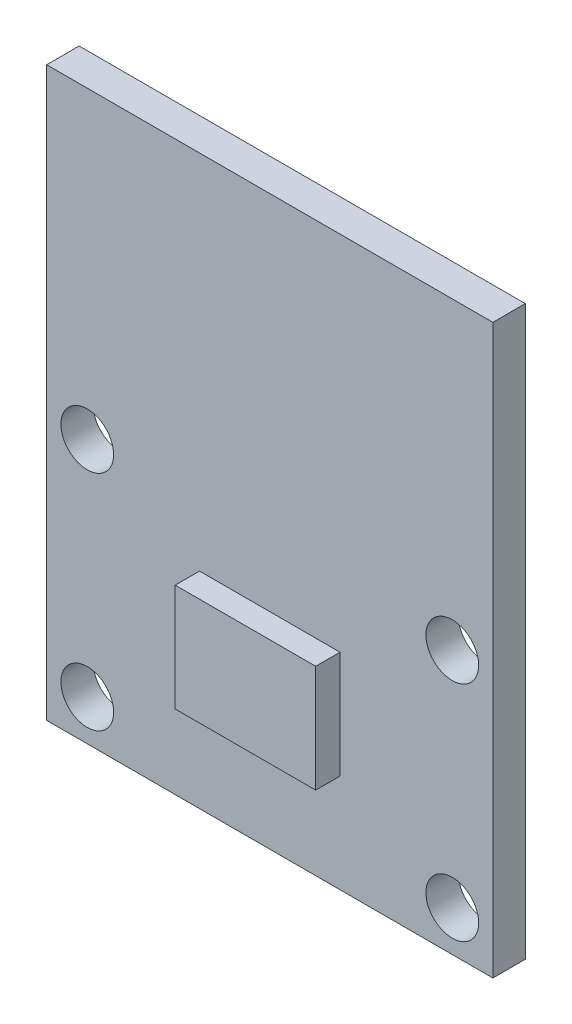
ISO-10303-21;
HEADER;
FILE_DESCRIPTION(('STEP AP214'),'2;1');
FILE_NAME('part.step','',(''),(''),'','','');
FILE_SCHEMA(('AUTOMOTIVE_DESIGN { 1 0 10303 214 1 1 1 1 }'));
ENDSEC;
DATA;
#1=APPLICATION_CONTEXT('core data for automotive mechanical design processes');
#2=APPLICATION_PROTOCOL_DEFINITION('international standard','automotive_design',2000,#1);
#3=PRODUCT_CONTEXT('',#1,'mechanical');
#4=PRODUCT('Part','Part','',(#3));
#5=PRODUCT_RELATED_PRODUCT_CATEGORY('part','',(#4));
#6=PRODUCT_DEFINITION_FORMATION('','',#4);
#7=PRODUCT_DEFINITION_CONTEXT('part definition',#1,'design');
#8=PRODUCT_DEFINITION('design','',#6,#7);
#9=PRODUCT_DEFINITION_SHAPE('','',#8);
#10=(LENGTH_UNIT() NAMED_UNIT(*) SI_UNIT(.MILLI.,.METRE.));
#11=(NAMED_UNIT(*) PLANE_ANGLE_UNIT() SI_UNIT($,.RADIAN.));
#12=(NAMED_UNIT(*) SI_UNIT($,.STERADIAN.) SOLID_ANGLE_UNIT());
#13=UNCERTAINTY_MEASURE_WITH_UNIT(LENGTH_MEASURE(1.E-05),#10,'distance_accuracy_value','');
#14=(GEOMETRIC_REPRESENTATION_CONTEXT(3) GLOBAL_UNCERTAINTY_ASSIGNED_CONTEXT((#13)) GLOBAL_UNIT_ASSIGNED_CONTEXT((#10,
#11,#12)) REPRESENTATION_CONTEXT('',''));
#15=CARTESIAN_POINT('',(0.,0.,0.));
#16=DIRECTION('',(0.,0.,1.));
#17=DIRECTION('',(1.,0.,0.));
#18=AXIS2_PLACEMENT_3D('',#15,#16,#17);
#19=CARTESIAN_POINT('',(0.,0.,1.6));
#20=DIRECTION('',(0.,0.,1.));
#21=DIRECTION('',(1.,0.,0.));
#22=AXIS2_PLACEMENT_3D('',#19,#20,#21);
#23=PLANE('',#22);
#24=CARTESIAN_POINT('',(-9.,-1.,1.6));
#25=DIRECTION('',(0.,0.,1.));
#26=DIRECTION('',(1.,0.,0.));
#27=AXIS2_PLACEMENT_3D('',#24,#25,#26);
#28=CIRCLE('',#27,1.3);
#29=CARTESIAN_POINT('',(-7.7,-1.,1.6));
#30=VERTEX_POINT('',#29);
#31=EDGE_CURVE('E146',#30,#30,#28,.T.);
#32=ORIENTED_EDGE('',*,*,#31,.F.);
#33=EDGE_LOOP('',(#32));
#34=FACE_BOUND('',#33,.T.);
#35=CARTESIAN_POINT('',(-9.,-12.,1.6));
#36=DIRECTION('',(0.,0.,1.));
#37=DIRECTION('',(1.,0.,0.));
#38=AXIS2_PLACEMENT_3D('',#35,#36,#37);
#39=CIRCLE('',#38,1.3);
#40=CARTESIAN_POINT('',(-7.7,-12.,1.6));
#41=VERTEX_POINT('',#40);
#42=EDGE_CURVE('E158',#41,#41,#39,.T.);
#43=ORIENTED_EDGE('',*,*,#42,.F.);
#44=EDGE_LOOP('',(#43));
#45=FACE_BOUND('',#44,.T.);
#46=DIRECTION('',(0.,1.,0.));
#47=VECTOR('',#46,1.);
#48=CARTESIAN_POINT('',(11.,14.,1.6));
#49=LINE('',#48,#47);
#50=CARTESIAN_POINT('',(11.,-14.,1.6));
#51=VERTEX_POINT('',#50);
#52=CARTESIAN_POINT('',(11.,14.,1.6));
#53=VERTEX_POINT('',#52);
#54=EDGE_CURVE('E164',#51,#53,#49,.T.);
#55=ORIENTED_EDGE('',*,*,#54,.T.);
#56=DIRECTION('',(-1.,0.,0.));
#57=VECTOR('',#56,1.);
#58=CARTESIAN_POINT('',(-11.,14.,1.6));
#59=LINE('',#58,#57);
#60=CARTESIAN_POINT('',(-11.,14.,1.6));
#61=VERTEX_POINT('',#60);
#62=EDGE_CURVE('E88',#53,#61,#59,.T.);
#63=ORIENTED_EDGE('',*,*,#62,.T.);
#64=DIRECTION('',(0.,-1.,0.));
#65=VECTOR('',#64,1.);
#66=CARTESIAN_POINT('',(-11.,14.,1.6));
#67=LINE('',#66,#65);
#68=CARTESIAN_POINT('',(-11.,-14.,1.6));
#69=VERTEX_POINT('',#68);
#70=EDGE_CURVE('E167',#61,#69,#67,.T.);
#71=ORIENTED_EDGE('',*,*,#70,.T.);
#72=DIRECTION('',(1.,0.,0.));
#73=VECTOR('',#72,1.);
#74=CARTESIAN_POINT('',(-11.,-14.,1.6));
#75=LINE('',#74,#73);
#76=EDGE_CURVE('E60',#69,#51,#75,.T.);
#77=ORIENTED_EDGE('',*,*,#76,.T.);
#78=EDGE_LOOP('',(#55,#63,#71,#77));
#79=FACE_BOUND('',#78,.T.);
#80=CARTESIAN_POINT('',(9.,-12.,1.6));
#81=DIRECTION('',(0.,0.,1.));
#82=DIRECTION('',(1.,0.,0.));
#83=AXIS2_PLACEMENT_3D('',#80,#81,#82);
#84=CIRCLE('',#83,1.3);
#85=CARTESIAN_POINT('',(10.3,-12.,1.6));
#86=VERTEX_POINT('',#85);
#87=EDGE_CURVE('E152',#86,#86,#84,.T.);
#88=ORIENTED_EDGE('',*,*,#87,.F.);
#89=EDGE_LOOP('',(#88));
#90=FACE_BOUND('',#89,.T.);
#91=CARTESIAN_POINT('',(9.,-1.,1.6));
#92=DIRECTION('',(0.,0.,1.));
#93=DIRECTION('',(1.,0.,0.));
#94=AXIS2_PLACEMENT_3D('',#91,#92,#93);
#95=CIRCLE('',#94,1.3);
#96=CARTESIAN_POINT('',(10.3,-1.,1.6));
#97=VERTEX_POINT('',#96);
#98=EDGE_CURVE('E138',#97,#97,#95,.T.);
#99=ORIENTED_EDGE('',*,*,#98,.F.);
#100=EDGE_LOOP('',(#99));
#101=FACE_BOUND('',#100,.T.);
#102=DIRECTION('',(-1.,0.,0.));
#103=VECTOR('',#102,1.);
#104=CARTESIAN_POINT('',(-3.46343343206932,-3.85520353665282,1.6));
#105=LINE('',#104,#103);
#106=CARTESIAN_POINT('',(3.46343343206932,-3.85520353665282,1.6));
#107=VERTEX_POINT('',#106);
#108=CARTESIAN_POINT('',(-3.46343343206932,-3.85520353665282,1.6));
#109=VERTEX_POINT('',#108);
#110=EDGE_CURVE('E334',#107,#109,#105,.T.);
#111=ORIENTED_EDGE('',*,*,#110,.F.);
#112=DIRECTION('',(0.,1.,0.));
#113=VECTOR('',#112,1.);
#114=CARTESIAN_POINT('',(3.46343343206932,-3.85520353665282,1.6));
#115=LINE('',#114,#113);
#116=CARTESIAN_POINT('',(3.46343343206932,-9.14479646334718,1.6));
#117=VERTEX_POINT('',#116);
#118=EDGE_CURVE('E133',#117,#107,#115,.T.);
#119=ORIENTED_EDGE('',*,*,#118,.F.);
#120=DIRECTION('',(1.,0.,0.));
#121=VECTOR('',#120,1.);
#122=CARTESIAN_POINT('',(-3.46343343206932,-9.14479646334718,1.6));
#123=LINE('',#122,#121);
#124=CARTESIAN_POINT('',(-3.46343343206932,-9.14479646334718,1.6));
#125=VERTEX_POINT('',#124);
#126=EDGE_CURVE('E129',#125,#117,#123,.T.);
#127=ORIENTED_EDGE('',*,*,#126,.F.);
#128=DIRECTION('',(0.,-1.,0.));
#129=VECTOR('',#128,1.);
#130=CARTESIAN_POINT('',(-3.46343343206932,-3.85520353665282,1.6));
#131=LINE('',#130,#129);
#132=EDGE_CURVE('E331',#109,#125,#131,.T.);
#133=ORIENTED_EDGE('',*,*,#132,.F.);
#134=EDGE_LOOP('',(#111,#119,#127,#133));
#135=FACE_BOUND('',#134,.T.);
#136=ADVANCED_FACE('F36',(#34,#45,#79,#90,#101,#135),#23,.T.);
#137=CARTESIAN_POINT('',(0.,0.,0.));
#138=DIRECTION('',(0.,0.,1.));
#139=DIRECTION('',(1.,0.,0.));
#140=AXIS2_PLACEMENT_3D('',#137,#138,#139);
#141=PLANE('',#140);
#142=DIRECTION('',(0.,1.,0.));
#143=VECTOR('',#142,1.);
#144=CARTESIAN_POINT('',(11.,14.,0.));
#145=LINE('',#144,#143);
#146=CARTESIAN_POINT('',(11.,-14.,0.));
#147=VERTEX_POINT('',#146);
#148=CARTESIAN_POINT('',(11.,14.,0.));
#149=VERTEX_POINT('',#148);
#150=EDGE_CURVE('E161',#147,#149,#145,.T.);
#151=ORIENTED_EDGE('',*,*,#150,.F.);
#152=DIRECTION('',(1.,0.,0.));
#153=VECTOR('',#152,1.);
#154=CARTESIAN_POINT('',(-11.,-14.,0.));
#155=LINE('',#154,#153);
#156=CARTESIAN_POINT('',(-11.,-14.,0.));
#157=VERTEX_POINT('',#156);
#158=EDGE_CURVE('E81',#157,#147,#155,.T.);
#159=ORIENTED_EDGE('',*,*,#158,.F.);
#160=DIRECTION('',(0.,-1.,0.));
#161=VECTOR('',#160,1.);
#162=CARTESIAN_POINT('',(-11.,14.,0.));
#163=LINE('',#162,#161);
#164=CARTESIAN_POINT('',(-11.,14.,0.));
#165=VERTEX_POINT('',#164);
#166=EDGE_CURVE('E175',#165,#157,#163,.T.);
#167=ORIENTED_EDGE('',*,*,#166,.F.);
#168=DIRECTION('',(-1.,0.,0.));
#169=VECTOR('',#168,1.);
#170=CARTESIAN_POINT('',(-11.,14.,0.));
#171=LINE('',#170,#169);
#172=EDGE_CURVE('E173',#149,#165,#171,.T.);
#173=ORIENTED_EDGE('',*,*,#172,.F.);
#174=EDGE_LOOP('',(#151,#159,#167,#173));
#175=FACE_BOUND('',#174,.T.);
#176=CARTESIAN_POINT('',(-9.,-12.,0.));
#177=DIRECTION('',(0.,0.,1.));
#178=DIRECTION('',(1.,0.,0.));
#179=AXIS2_PLACEMENT_3D('',#176,#177,#178);
#180=CIRCLE('',#179,1.3);
#181=CARTESIAN_POINT('',(-7.7,-12.,0.));
#182=VERTEX_POINT('',#181);
#183=EDGE_CURVE('E155',#182,#182,#180,.T.);
#184=ORIENTED_EDGE('',*,*,#183,.T.);
#185=EDGE_LOOP('',(#184));
#186=FACE_BOUND('',#185,.T.);
#187=CARTESIAN_POINT('',(9.,-12.,0.));
#188=DIRECTION('',(0.,0.,1.));
#189=DIRECTION('',(1.,0.,0.));
#190=AXIS2_PLACEMENT_3D('',#187,#188,#189);
#191=CIRCLE('',#190,1.3);
#192=CARTESIAN_POINT('',(10.3,-12.,0.));
#193=VERTEX_POINT('',#192);
#194=EDGE_CURVE('E149',#193,#193,#191,.T.);
#195=ORIENTED_EDGE('',*,*,#194,.T.);
#196=EDGE_LOOP('',(#195));
#197=FACE_BOUND('',#196,.T.);
#198=CARTESIAN_POINT('',(-9.,-1.,0.));
#199=DIRECTION('',(0.,0.,1.));
#200=DIRECTION('',(1.,0.,0.));
#201=AXIS2_PLACEMENT_3D('',#198,#199,#200);
#202=CIRCLE('',#201,1.3);
#203=CARTESIAN_POINT('',(-7.7,-1.,0.));
#204=VERTEX_POINT('',#203);
#205=EDGE_CURVE('E144',#204,#204,#202,.T.);
#206=ORIENTED_EDGE('',*,*,#205,.T.);
#207=EDGE_LOOP('',(#206));
#208=FACE_BOUND('',#207,.T.);
#209=CARTESIAN_POINT('',(9.,-1.,0.));
#210=DIRECTION('',(0.,0.,1.));
#211=DIRECTION('',(1.,0.,0.));
#212=AXIS2_PLACEMENT_3D('',#209,#210,#211);
#213=CIRCLE('',#212,1.3);
#214=CARTESIAN_POINT('',(10.3,-1.,0.));
#215=VERTEX_POINT('',#214);
#216=EDGE_CURVE('E135',#215,#215,#213,.T.);
#217=ORIENTED_EDGE('',*,*,#216,.T.);
#218=EDGE_LOOP('',(#217));
#219=FACE_BOUND('',#218,.T.);
#220=ADVANCED_FACE('F188',(#175,#186,#197,#208,#219),#141,.F.);
#221=CARTESIAN_POINT('',(11.,14.,1.6));
#222=DIRECTION('',(-1.,0.,0.));
#223=DIRECTION('',(0.,-1.,0.));
#224=AXIS2_PLACEMENT_3D('',#221,#222,#223);
#225=PLANE('',#224);
#226=ORIENTED_EDGE('',*,*,#150,.T.);
#227=DIRECTION('',(0.,0.,-1.));
#228=VECTOR('',#227,1.);
#229=CARTESIAN_POINT('',(11.,14.,1.6));
#230=LINE('',#229,#228);
#231=EDGE_CURVE('E11',#53,#149,#230,.T.);
#232=ORIENTED_EDGE('',*,*,#231,.F.);
#233=ORIENTED_EDGE('',*,*,#54,.F.);
#234=DIRECTION('',(0.,0.,-1.));
#235=VECTOR('',#234,1.);
#236=CARTESIAN_POINT('',(11.,-14.,1.6));
#237=LINE('',#236,#235);
#238=EDGE_CURVE('E170',#51,#147,#237,.T.);
#239=ORIENTED_EDGE('',*,*,#238,.T.);
#240=EDGE_LOOP('',(#226,#232,#233,#239));
#241=FACE_BOUND('',#240,.T.);
#242=ADVANCED_FACE('F38',(#241),#225,.F.);
#243=CARTESIAN_POINT('',(-11.,14.,1.6));
#244=DIRECTION('',(0.,-1.,0.));
#245=DIRECTION('',(0.,0.,-1.));
#246=AXIS2_PLACEMENT_3D('',#243,#244,#245);
#247=PLANE('',#246);
#248=ORIENTED_EDGE('',*,*,#172,.T.);
#249=DIRECTION('',(0.,0.,-1.));
#250=VECTOR('',#249,1.);
#251=CARTESIAN_POINT('',(-11.,14.,1.6));
#252=LINE('',#251,#250);
#253=EDGE_CURVE('E44',#61,#165,#252,.T.);
#254=ORIENTED_EDGE('',*,*,#253,.F.);
#255=ORIENTED_EDGE('',*,*,#62,.F.);
#256=ORIENTED_EDGE('',*,*,#231,.T.);
#257=EDGE_LOOP('',(#248,#254,#255,#256));
#258=FACE_BOUND('',#257,.T.);
#259=ADVANCED_FACE('F204',(#258),#247,.F.);
#260=CARTESIAN_POINT('',(-11.,14.,1.6));
#261=DIRECTION('',(1.,0.,0.));
#262=DIRECTION('',(0.,1.,0.));
#263=AXIS2_PLACEMENT_3D('',#260,#261,#262);
#264=PLANE('',#263);
#265=ORIENTED_EDGE('',*,*,#166,.T.);
#266=DIRECTION('',(0.,0.,-1.));
#267=VECTOR('',#266,1.);
#268=CARTESIAN_POINT('',(-11.,-14.,1.6));
#269=LINE('',#268,#267);
#270=EDGE_CURVE('E179',#69,#157,#269,.T.);
#271=ORIENTED_EDGE('',*,*,#270,.F.);
#272=ORIENTED_EDGE('',*,*,#70,.F.);
#273=ORIENTED_EDGE('',*,*,#253,.T.);
#274=EDGE_LOOP('',(#265,#271,#272,#273));
#275=FACE_BOUND('',#274,.T.);
#276=ADVANCED_FACE('F184',(#275),#264,.F.);
#277=CARTESIAN_POINT('',(-11.,-14.,1.6));
#278=DIRECTION('',(0.,1.,0.));
#279=DIRECTION('',(0.,0.,1.));
#280=AXIS2_PLACEMENT_3D('',#277,#278,#279);
#281=PLANE('',#280);
#282=ORIENTED_EDGE('',*,*,#158,.T.);
#283=ORIENTED_EDGE('',*,*,#238,.F.);
#284=ORIENTED_EDGE('',*,*,#76,.F.);
#285=ORIENTED_EDGE('',*,*,#270,.T.);
#286=EDGE_LOOP('',(#282,#283,#284,#285));
#287=FACE_BOUND('',#286,.T.);
#288=ADVANCED_FACE('F193',(#287),#281,.F.);
#289=CARTESIAN_POINT('',(-9.,-12.,1.6));
#290=DIRECTION('',(0.,0.,-1.));
#291=DIRECTION('',(-1.,0.,0.));
#292=AXIS2_PLACEMENT_3D('',#289,#290,#291);
#293=CYLINDRICAL_SURFACE('',#292,1.3);
#294=ORIENTED_EDGE('',*,*,#42,.T.);
#295=EDGE_LOOP('',(#294));
#296=FACE_BOUND('',#295,.T.);
#297=ORIENTED_EDGE('',*,*,#183,.F.);
#298=EDGE_LOOP('',(#297));
#299=FACE_BOUND('',#298,.T.);
#300=ADVANCED_FACE('F195',(#296,#299),#293,.F.);
#301=CARTESIAN_POINT('',(9.,-12.,1.6));
#302=DIRECTION('',(0.,0.,-1.));
#303=DIRECTION('',(-1.,0.,0.));
#304=AXIS2_PLACEMENT_3D('',#301,#302,#303);
#305=CYLINDRICAL_SURFACE('',#304,1.3);
#306=ORIENTED_EDGE('',*,*,#87,.T.);
#307=EDGE_LOOP('',(#306));
#308=FACE_BOUND('',#307,.T.);
#309=ORIENTED_EDGE('',*,*,#194,.F.);
#310=EDGE_LOOP('',(#309));
#311=FACE_BOUND('',#310,.T.);
#312=ADVANCED_FACE('F201',(#308,#311),#305,.F.);
#313=CARTESIAN_POINT('',(-9.,-1.,1.6));
#314=DIRECTION('',(0.,0.,-1.));
#315=DIRECTION('',(-1.,0.,0.));
#316=AXIS2_PLACEMENT_3D('',#313,#314,#315);
#317=CYLINDRICAL_SURFACE('',#316,1.3);
#318=ORIENTED_EDGE('',*,*,#31,.T.);
#319=EDGE_LOOP('',(#318));
#320=FACE_BOUND('',#319,.T.);
#321=ORIENTED_EDGE('',*,*,#205,.F.);
#322=EDGE_LOOP('',(#321));
#323=FACE_BOUND('',#322,.T.);
#324=ADVANCED_FACE('F218',(#320,#323),#317,.F.);
#325=CARTESIAN_POINT('',(9.,-1.,1.6));
#326=DIRECTION('',(0.,0.,-1.));
#327=DIRECTION('',(-1.,0.,0.));
#328=AXIS2_PLACEMENT_3D('',#325,#326,#327);
#329=CYLINDRICAL_SURFACE('',#328,1.3);
#330=ORIENTED_EDGE('',*,*,#98,.T.);
#331=EDGE_LOOP('',(#330));
#332=FACE_BOUND('',#331,.T.);
#333=ORIENTED_EDGE('',*,*,#216,.F.);
#334=EDGE_LOOP('',(#333));
#335=FACE_BOUND('',#334,.T.);
#336=ADVANCED_FACE('F222',(#332,#335),#329,.F.);
#337=CARTESIAN_POINT('',(3.46343343206932,-3.85520353665282,2.8));
#338=DIRECTION('',(-1.,0.,0.));
#339=DIRECTION('',(0.,0.,1.));
#340=AXIS2_PLACEMENT_3D('',#337,#338,#339);
#341=PLANE('',#340);
#342=ORIENTED_EDGE('',*,*,#118,.T.);
#343=DIRECTION('',(0.,0.,-1.));
#344=VECTOR('',#343,1.);
#345=CARTESIAN_POINT('',(3.46343343206932,-3.85520353665282,2.8));
#346=LINE('',#345,#344);
#347=CARTESIAN_POINT('',(3.46343343206932,-3.85520353665282,2.8));
#348=VERTEX_POINT('',#347);
#349=EDGE_CURVE('E114',#348,#107,#346,.T.);
#350=ORIENTED_EDGE('',*,*,#349,.F.);
#351=DIRECTION('',(0.,1.,0.));
#352=VECTOR('',#351,1.);
#353=CARTESIAN_POINT('',(3.46343343206932,-3.85520353665282,2.8));
#354=LINE('',#353,#352);
#355=CARTESIAN_POINT('',(3.46343343206932,-9.14479646334718,2.8));
#356=VERTEX_POINT('',#355);
#357=EDGE_CURVE('E121',#356,#348,#354,.T.);
#358=ORIENTED_EDGE('',*,*,#357,.F.);
#359=DIRECTION('',(0.,0.,-1.));
#360=VECTOR('',#359,1.);
#361=CARTESIAN_POINT('',(3.46343343206932,-9.14479646334718,2.8));
#362=LINE('',#361,#360);
#363=EDGE_CURVE('E328',#356,#117,#362,.T.);
#364=ORIENTED_EDGE('',*,*,#363,.T.);
#365=EDGE_LOOP('',(#342,#350,#358,#364));
#366=FACE_BOUND('',#365,.T.);
#367=ADVANCED_FACE('F131',(#366),#341,.F.);
#368=CARTESIAN_POINT('',(-3.46343343206932,-3.85520353665282,2.8));
#369=DIRECTION('',(0.,-1.,0.));
#370=DIRECTION('',(0.,0.,-1.));
#371=AXIS2_PLACEMENT_3D('',#368,#369,#370);
#372=PLANE('',#371);
#373=ORIENTED_EDGE('',*,*,#110,.T.);
#374=DIRECTION('',(0.,0.,-1.));
#375=VECTOR('',#374,1.);
#376=CARTESIAN_POINT('',(-3.46343343206932,-3.85520353665282,2.8));
#377=LINE('',#376,#375);
#378=CARTESIAN_POINT('',(-3.46343343206932,-3.85520353665282,2.8));
#379=VERTEX_POINT('',#378);
#380=EDGE_CURVE('E117',#379,#109,#377,.T.);
#381=ORIENTED_EDGE('',*,*,#380,.F.);
#382=DIRECTION('',(-1.,0.,0.));
#383=VECTOR('',#382,1.);
#384=CARTESIAN_POINT('',(-3.46343343206932,-3.85520353665282,2.8));
#385=LINE('',#384,#383);
#386=EDGE_CURVE('E110',#348,#379,#385,.T.);
#387=ORIENTED_EDGE('',*,*,#386,.F.);
#388=ORIENTED_EDGE('',*,*,#349,.T.);
#389=EDGE_LOOP('',(#373,#381,#387,#388));
#390=FACE_BOUND('',#389,.T.);
#391=ADVANCED_FACE('F112',(#390),#372,.F.);
#392=CARTESIAN_POINT('',(-3.46343343206932,-3.85520353665282,2.8));
#393=DIRECTION('',(1.,0.,0.));
#394=DIRECTION('',(0.,0.,-1.));
#395=AXIS2_PLACEMENT_3D('',#392,#393,#394);
#396=PLANE('',#395);
#397=ORIENTED_EDGE('',*,*,#132,.T.);
#398=DIRECTION('',(0.,0.,-1.));
#399=VECTOR('',#398,1.);
#400=CARTESIAN_POINT('',(-3.46343343206932,-9.14479646334718,2.8));
#401=LINE('',#400,#399);
#402=CARTESIAN_POINT('',(-3.46343343206932,-9.14479646334718,2.8));
#403=VERTEX_POINT('',#402);
#404=EDGE_CURVE('E51',#403,#125,#401,.T.);
#405=ORIENTED_EDGE('',*,*,#404,.F.);
#406=DIRECTION('',(0.,-1.,0.));
#407=VECTOR('',#406,1.);
#408=CARTESIAN_POINT('',(-3.46343343206932,-3.85520353665282,2.8));
#409=LINE('',#408,#407);
#410=EDGE_CURVE('E120',#379,#403,#409,.T.);
#411=ORIENTED_EDGE('',*,*,#410,.F.);
#412=ORIENTED_EDGE('',*,*,#380,.T.);
#413=EDGE_LOOP('',(#397,#405,#411,#412));
#414=FACE_BOUND('',#413,.T.);
#415=ADVANCED_FACE('F231',(#414),#396,.F.);
#416=CARTESIAN_POINT('',(-3.46343343206932,-9.14479646334718,2.8));
#417=DIRECTION('',(0.,1.,0.));
#418=DIRECTION('',(0.,0.,1.));
#419=AXIS2_PLACEMENT_3D('',#416,#417,#418);
#420=PLANE('',#419);
#421=ORIENTED_EDGE('',*,*,#126,.T.);
#422=ORIENTED_EDGE('',*,*,#363,.F.);
#423=DIRECTION('',(1.,0.,0.));
#424=VECTOR('',#423,1.);
#425=CARTESIAN_POINT('',(-3.46343343206932,-9.14479646334718,2.8));
#426=LINE('',#425,#424);
#427=EDGE_CURVE('E125',#403,#356,#426,.T.);
#428=ORIENTED_EDGE('',*,*,#427,.F.);
#429=ORIENTED_EDGE('',*,*,#404,.T.);
#430=EDGE_LOOP('',(#421,#422,#428,#429));
#431=FACE_BOUND('',#430,.T.);
#432=ADVANCED_FACE('F234',(#431),#420,.F.);
#433=CARTESIAN_POINT('',(0.,0.,2.8));
#434=DIRECTION('',(0.,0.,1.));
#435=DIRECTION('',(1.,0.,0.));
#436=AXIS2_PLACEMENT_3D('',#433,#434,#435);
#437=PLANE('',#436);
#438=ORIENTED_EDGE('',*,*,#357,.T.);
#439=ORIENTED_EDGE('',*,*,#386,.T.);
#440=ORIENTED_EDGE('',*,*,#410,.T.);
#441=ORIENTED_EDGE('',*,*,#427,.T.);
#442=EDGE_LOOP('',(#438,#439,#440,#441));
#443=FACE_BOUND('',#442,.T.);
#444=ADVANCED_FACE('F124',(#443),#437,.T.);
#445=CLOSED_SHELL('',(#136,#220,#242,#259,#276,#288,#300,#312,#324,#336,#367,#391,#415,#432,#444));
#446=MANIFOLD_SOLID_BREP('B2',#445);
#447=ADVANCED_BREP_SHAPE_REPRESENTATION('',(#18,#446),#14);
#448=SHAPE_DEFINITION_REPRESENTATION(#9,#447);
ENDSEC;
END-ISO-10303-21;
